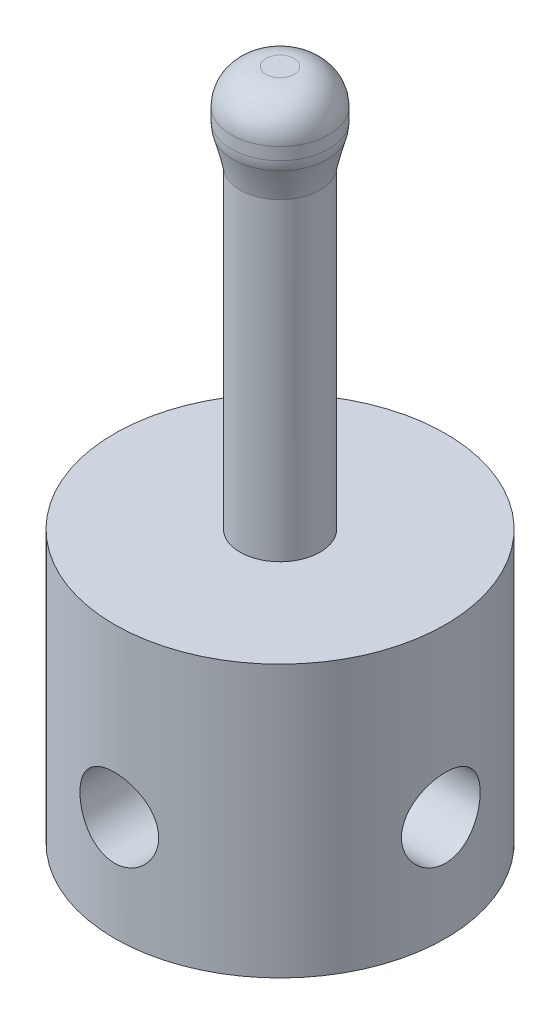
ISO-10303-21;
HEADER;
FILE_DESCRIPTION(('STEP AP214'),'2;1');
FILE_NAME('part.step','',(''),(''),'','','');
FILE_SCHEMA(('AUTOMOTIVE_DESIGN { 1 0 10303 214 1 1 1 1 }'));
ENDSEC;
DATA;
#1=APPLICATION_CONTEXT('core data for automotive mechanical design processes');
#2=APPLICATION_PROTOCOL_DEFINITION('international standard','automotive_design',2000,#1);
#3=PRODUCT_CONTEXT('',#1,'mechanical');
#4=PRODUCT('Part','Part','',(#3));
#5=PRODUCT_RELATED_PRODUCT_CATEGORY('part','',(#4));
#6=PRODUCT_DEFINITION_FORMATION('','',#4);
#7=PRODUCT_DEFINITION_CONTEXT('part definition',#1,'design');
#8=PRODUCT_DEFINITION('design','',#6,#7);
#9=PRODUCT_DEFINITION_SHAPE('','',#8);
#10=(LENGTH_UNIT() NAMED_UNIT(*) SI_UNIT(.MILLI.,.METRE.));
#11=(NAMED_UNIT(*) PLANE_ANGLE_UNIT() SI_UNIT($,.RADIAN.));
#12=(NAMED_UNIT(*) SI_UNIT($,.STERADIAN.) SOLID_ANGLE_UNIT());
#13=UNCERTAINTY_MEASURE_WITH_UNIT(LENGTH_MEASURE(1.E-05),#10,'distance_accuracy_value','');
#14=(GEOMETRIC_REPRESENTATION_CONTEXT(3) GLOBAL_UNCERTAINTY_ASSIGNED_CONTEXT((#13)) GLOBAL_UNIT_ASSIGNED_CONTEXT((#10,
#11,#12)) REPRESENTATION_CONTEXT('',''));
#15=CARTESIAN_POINT('',(0.,0.,0.));
#16=DIRECTION('',(0.,0.,1.));
#17=DIRECTION('',(1.,0.,0.));
#18=AXIS2_PLACEMENT_3D('',#15,#16,#17);
#19=CARTESIAN_POINT('',(0.,45.212,0.));
#20=DIRECTION('',(0.,-1.,0.));
#21=DIRECTION('',(0.,0.,-1.));
#22=AXIS2_PLACEMENT_3D('',#19,#20,#21);
#23=CYLINDRICAL_SURFACE('',#22,2.921);
#24=CARTESIAN_POINT('',(0.,19.812,0.));
#25=DIRECTION('',(0.,1.,0.));
#26=DIRECTION('',(0.,0.,1.));
#27=AXIS2_PLACEMENT_3D('',#24,#25,#26);
#28=CIRCLE('',#27,2.921);
#29=CARTESIAN_POINT('',(0.,19.812,2.921));
#30=VERTEX_POINT('',#29);
#31=EDGE_CURVE('E178',#30,#30,#28,.T.);
#32=ORIENTED_EDGE('',*,*,#31,.T.);
#33=EDGE_LOOP('',(#32));
#34=FACE_BOUND('',#33,.T.);
#35=CARTESIAN_POINT('',(2.78197921367793,42.672,0.890411508609308));
#36=CARTESIAN_POINT('',(4.56280223089655,42.672,-4.67354691874656));
#37=CARTESIAN_POINT('',(-1.00115619645932,42.672,-6.45436993596517));
#38=CARTESIAN_POINT('',(-2.78197921367793,42.672,-0.890411508609307));
#39=CARTESIAN_POINT('',(-4.56280223089655,42.672,4.67354691874656));
#40=CARTESIAN_POINT('',(1.00115619645932,42.672,6.45436993596518));
#41=CARTESIAN_POINT('',(2.78197921367793,42.672,0.890411508609308));
#42=(BOUNDED_CURVE() B_SPLINE_CURVE(3,(#35,#36,#37,#38,#39,#40,#41),.UNSPECIFIED.,.T.,
.F.) B_SPLINE_CURVE_WITH_KNOTS((4,3,4),(0.,0.5,1.),
.UNSPECIFIED.) CURVE() GEOMETRIC_REPRESENTATION_ITEM() RATIONAL_B_SPLINE_CURVE((1.,
0.333333333333333,0.333333333333333,1.,0.333333333333333,0.333333333333333,1.)) REPRESENTATION_ITEM(''));
#43=CARTESIAN_POINT('',(2.78197921367793,42.672,0.890411508609308));
#44=VERTEX_POINT('',#43);
#45=EDGE_CURVE('E81',#44,#44,#42,.T.);
#46=ORIENTED_EDGE('',*,*,#45,.F.);
#47=EDGE_LOOP('',(#46));
#48=FACE_BOUND('',#47,.T.);
#49=ADVANCED_FACE('F43',(#34,#48),#23,.T.);
#50=CARTESIAN_POINT('',(0.,7.62,-12.7));
#51=DIRECTION('',(0.,0.,1.));
#52=DIRECTION('',(1.,0.,0.));
#53=AXIS2_PLACEMENT_3D('',#50,#51,#52);
#54=CYLINDRICAL_SURFACE('',#53,2.8702);
#55=CARTESIAN_POINT('',(2.8702,7.62,11.7186252162956));
#56=CARTESIAN_POINT('',(2.87019507712011,7.4612467948511,11.7186283624697));
#57=CARTESIAN_POINT('',(2.85698399408568,7.30243731393648,11.721886375238));
#58=CARTESIAN_POINT('',(2.80456224388418,6.98936102472241,11.7345369276058));
#59=CARTESIAN_POINT('',(2.76533498344832,6.83509718128338,11.7439333822817));
#60=CARTESIAN_POINT('',(2.66220777124437,6.53568591177346,11.7677377556552));
#61=CARTESIAN_POINT('',(2.59833773696873,6.39052767854076,11.7821395954834));
#62=CARTESIAN_POINT('',(2.44782708582268,6.11297588595014,11.8143245587934));
#63=CARTESIAN_POINT('',(2.36118607051201,5.98058255000424,11.8321077414396));
#64=CARTESIAN_POINT('',(2.16574851562255,5.72967760799566,11.86944844061));
#65=CARTESIAN_POINT('',(2.05658205451984,5.61145797913338,11.8890320853377));
#66=CARTESIAN_POINT('',(1.81998998788974,5.3948224552246,11.9275396495467));
#67=CARTESIAN_POINT('',(1.69256279722548,5.29640828119106,11.9464635115775));
#68=CARTESIAN_POINT('',(1.42108316644156,5.12099855005224,11.9818066094164));
#69=CARTESIAN_POINT('',(1.27684207301624,5.04428743323252,11.9981914146258));
#70=CARTESIAN_POINT('',(0.977058943521645,4.91630707275891,12.0263133715791));
#71=CARTESIAN_POINT('',(0.821518416172498,4.86503443964601,12.0380511424582));
#72=CARTESIAN_POINT('',(0.506592571240832,4.79031495130523,12.0553718215547));
#73=CARTESIAN_POINT('',(0.347330863101816,4.76637290376586,12.0610641281655));
#74=CARTESIAN_POINT('',(0.0269565192068503,4.74544229497584,12.0660328575786));
#75=CARTESIAN_POINT('',(-0.134155864860742,4.74845011094195,12.0653101427316));
#76=CARTESIAN_POINT('',(-0.450232104324782,4.78097259916064,12.0576125705577));
#77=CARTESIAN_POINT('',(-0.605254451761177,4.80995307663434,12.0507637185175));
#78=CARTESIAN_POINT('',(-0.908169690114576,4.89274256770294,12.0317288304518));
#79=CARTESIAN_POINT('',(-1.05606222233691,4.94655282902551,12.0195425262142));
#80=CARTESIAN_POINT('',(-1.34195733835544,5.07792264082235,11.9910052387087));
#81=CARTESIAN_POINT('',(-1.47986676272579,5.15567723940197,11.9746202445134));
#82=CARTESIAN_POINT('',(-1.7408705418565,5.33258167152713,11.9394708155277));
#83=CARTESIAN_POINT('',(-1.86396253510917,5.43173490843722,11.9207060024331));
#84=CARTESIAN_POINT('',(-2.0950202545461,5.65150406837535,11.882305664572));
#85=CARTESIAN_POINT('',(-2.20254037364524,5.7725871948228,11.8626600735999));
#86=CARTESIAN_POINT('',(-2.39584228220077,6.03127120296817,11.8251379870424));
#87=CARTESIAN_POINT('',(-2.48162324254348,6.16887271436887,11.8072615589474));
#88=CARTESIAN_POINT('',(-2.62926132211173,6.45749925143557,11.7752692484766));
#89=CARTESIAN_POINT('',(-2.69102052321649,6.60857619505951,11.7611688291768));
#90=CARTESIAN_POINT('',(-2.7881314686316,6.91938244600731,11.7385289032223));
#91=CARTESIAN_POINT('',(-2.82348826478093,7.07911009182856,11.7299883327856));
#92=CARTESIAN_POINT('',(-2.86607095415289,7.3985755046003,11.7196559281142));
#93=CARTESIAN_POINT('',(-2.873951670472,7.55822101188633,11.7177070323229));
#94=CARTESIAN_POINT('',(-2.86314326147136,7.87654526477713,11.7203526514889));
#95=CARTESIAN_POINT('',(-2.84445632778626,8.03522408904169,11.7249466267078));
#96=CARTESIAN_POINT('',(-2.78161490911294,8.34474068284352,11.740010719636));
#97=CARTESIAN_POINT('',(-2.73783331925917,8.49565874640959,11.7503947397794));
#98=CARTESIAN_POINT('',(-2.62645489538405,8.78801542326033,11.775788800627));
#99=CARTESIAN_POINT('',(-2.55885545058739,8.92945299532468,11.7907993484418));
#100=CARTESIAN_POINT('',(-2.40036086835858,9.20163218932803,11.8240916041208));
#101=CARTESIAN_POINT('',(-2.30906944684217,9.33213631762805,11.8424271807101));
#102=CARTESIAN_POINT('',(-2.10629034792798,9.57621345369849,11.8801674894003));
#103=CARTESIAN_POINT('',(-1.99479967902445,9.68978394905239,11.8995723795697));
#104=CARTESIAN_POINT('',(-1.75179834857281,9.89937778161937,11.9377913448837));
#105=CARTESIAN_POINT('',(-1.61989494375779,9.99495072026906,11.9565824261358));
#106=CARTESIAN_POINT('',(-1.34152823277244,10.1625857493513,11.9910035227366));
#107=CARTESIAN_POINT('',(-1.19506566235932,10.2346490270731,12.0066336977029));
#108=CARTESIAN_POINT('',(-0.892720369182497,10.3526253273366,12.0328765081443));
#109=CARTESIAN_POINT('',(-0.736911255447969,10.39871894667,12.0435237059095));
#110=CARTESIAN_POINT('',(-0.419474774698135,10.463999569568,12.058751526131));
#111=CARTESIAN_POINT('',(-0.257848422963589,10.4831912451882,12.0633332019777));
#112=CARTESIAN_POINT('',(0.0623860488194604,10.4938813686057,12.0658754408616));
#113=CARTESIAN_POINT('',(0.22097096878876,10.4860474925368,12.0639956412166));
#114=CARTESIAN_POINT('',(0.534495154115172,10.4444237618679,12.0541753287779));
#115=CARTESIAN_POINT('',(0.68943450962772,10.4106345498447,12.0462349660256));
#116=CARTESIAN_POINT('',(0.990643308362125,10.3184028088616,12.025205347781));
#117=CARTESIAN_POINT('',(1.13694826801125,10.2600706682665,12.0121391646089));
#118=CARTESIAN_POINT('',(1.41777490361002,10.1205111741056,11.9822412093009));
#119=CARTESIAN_POINT('',(1.55229522074609,10.0392811848743,11.9654090037215));
#120=CARTESIAN_POINT('',(1.80893753933761,9.85413888530335,11.9293398580588));
#121=CARTESIAN_POINT('',(1.93072154509699,9.74976674891245,11.9100581492564));
#122=CARTESIAN_POINT('',(2.15527370777172,9.52220980802151,11.8714797070049));
#123=CARTESIAN_POINT('',(2.25803714451626,9.39902034759528,11.8521829710164));
#124=CARTESIAN_POINT('',(2.44328083409938,9.13488438362675,11.815400607272));
#125=CARTESIAN_POINT('',(2.52539930116137,8.99367892719086,11.7979500270026));
#126=CARTESIAN_POINT('',(2.66460856774315,8.6990767749998,11.7672938346263));
#127=CARTESIAN_POINT('',(2.72171879582258,8.54568965285731,11.7540849293553));
#128=CARTESIAN_POINT('',(2.80009817036185,8.26365811902299,11.7356263002026));
#129=CARTESIAN_POINT('',(2.82633191670105,8.13644109700393,11.7292965233046));
#130=CARTESIAN_POINT('',(2.8613842440036,7.87949513464925,11.7207948386304));
#131=CARTESIAN_POINT('',(2.87020402400848,7.74976636788139,11.7186226445833));
#132=CARTESIAN_POINT('',(2.8702,7.62,11.7186252162956));
#133=B_SPLINE_CURVE_WITH_KNOTS('',3,(#55,#56,#57,#58,#59,#60,#61,#62,#63,#64,#65,#66,#67,#68,
#69,#70,#71,#72,#73,#74,#75,#76,#77,#78,#79,#80,#81,#82,#83,#84,#85,#86,#87,#88,#89,#90,#91,#92,
#93,#94,#95,#96,#97,#98,#99,#100,#101,#102,#103,#104,#105,#106,#107,#108,#109,#110,#111,#112,
#113,#114,#115,#116,#117,#118,#119,#120,#121,#122,#123,#124,#125,#126,#127,#128,#129,#130,#131,
#132),.UNSPECIFIED.,.T.,.F.,(4,2,2,2,2,2,2,2,2,2,2,2,2,2,2,2,2,2,2,2,2,2,2,2,2,2,2,2,2,2,2,2,2,
2,2,2,2,2,4),(0.,0.47578347546477,0.951870700595232,1.42738174286469,1.90290110604732,
2.38695968264342,2.87106030380335,3.36123914703593,3.85135266060468,4.33243756324848,
4.81345779617098,5.28480605798789,5.75617800822378,6.23149609129388,6.70688982751665,
7.19395603784801,7.68104082169047,8.17009077107241,8.65904712159096,9.13626765141134,
9.61344881635103,10.0837166021535,10.554035952032,11.0327954408554,11.5116258919394,
12.0011896985105,12.4907287772117,12.9768201264414,13.4628270458138,13.9369138634531,
14.410988944495,14.8829541635747,15.354973730588,15.8373809469388,16.319907718094,
16.8103785661843,17.3004676952063,17.6894043787698,18.0783142811),.UNSPECIFIED.);
#134=CARTESIAN_POINT('',(2.8702,7.62,11.7186252162956));
#135=VERTEX_POINT('',#134);
#136=EDGE_CURVE('E123',#135,#135,#133,.T.);
#137=ORIENTED_EDGE('',*,*,#136,.F.);
#138=EDGE_LOOP('',(#137));
#139=FACE_BOUND('',#138,.T.);
#140=CARTESIAN_POINT('',(0.,7.62,0.));
#141=DIRECTION('',(0.707106781186546,0.,0.707106781186549));
#142=DIRECTION('',(-0.707106781186549,0.,0.707106781186546));
#143=AXIS2_PLACEMENT_3D('',#140,#141,#142);
#144=ELLIPSE('',#143,4.05907576672325,2.8702);
#145=CARTESIAN_POINT('',(0.,4.7498,0.));
#146=VERTEX_POINT('',#145);
#147=CARTESIAN_POINT('',(0.,10.4902,0.));
#148=VERTEX_POINT('',#147);
#149=EDGE_CURVE('E58',#146,#148,#144,.F.);
#150=ORIENTED_EDGE('',*,*,#149,.T.);
#151=CARTESIAN_POINT('',(0.,7.62,0.));
#152=DIRECTION('',(-0.707106781186549,0.,0.707106781186546));
#153=DIRECTION('',(0.707106781186546,0.,0.707106781186549));
#154=AXIS2_PLACEMENT_3D('',#151,#152,#153);
#155=ELLIPSE('',#154,4.05907576672326,2.8702);
#156=EDGE_CURVE('E67',#148,#146,#155,.F.);
#157=ORIENTED_EDGE('',*,*,#156,.T.);
#158=EDGE_LOOP('',(#150,#157));
#159=FACE_BOUND('',#158,.T.);
#160=ADVANCED_FACE('F79',(#139,#159),#54,.F.);
#161=CARTESIAN_POINT('',(0.,19.812,0.));
#162=DIRECTION('',(0.,-1.,0.));
#163=DIRECTION('',(0.,0.,-1.));
#164=AXIS2_PLACEMENT_3D('',#161,#162,#163);
#165=CYLINDRICAL_SURFACE('',#164,12.065);
#166=CARTESIAN_POINT('',(11.7186252162956,7.62,2.87020000000004));
#167=CARTESIAN_POINT('',(11.7186283624697,7.7787532051489,2.87019507712015));
#168=CARTESIAN_POINT('',(11.721886375238,7.93756268606352,2.85698399408572));
#169=CARTESIAN_POINT('',(11.7345369276058,8.25063897527759,2.80456224388422));
#170=CARTESIAN_POINT('',(11.7439333822817,8.40490281871662,2.76533498344836));
#171=CARTESIAN_POINT('',(11.7677377556552,8.70431408822654,2.66220777124441));
#172=CARTESIAN_POINT('',(11.7821395954834,8.84947232145924,2.59833773696877));
#173=CARTESIAN_POINT('',(11.8143245587934,9.12702411404986,2.44782708582272));
#174=CARTESIAN_POINT('',(11.8321077414395,9.25941744999576,2.36118607051205));
#175=CARTESIAN_POINT('',(11.86944844061,9.51032239200433,2.16574851562259));
#176=CARTESIAN_POINT('',(11.8890320853377,9.62854202086662,2.05658205451988));
#177=CARTESIAN_POINT('',(11.9275396495467,9.8451775447754,1.81998998788978));
#178=CARTESIAN_POINT('',(11.9464635115775,9.94359171880894,1.69256279722552));
#179=CARTESIAN_POINT('',(11.9818066094164,10.1190014499478,1.4210831664416));
#180=CARTESIAN_POINT('',(11.9981914146258,10.1957125667675,1.27684207301628));
#181=CARTESIAN_POINT('',(12.0263133715791,10.3236929272411,0.977058943521689));
#182=CARTESIAN_POINT('',(12.0380511424581,10.374965560354,0.821518416172542));
#183=CARTESIAN_POINT('',(12.0553718215547,10.4496850486948,0.506592571240877));
#184=CARTESIAN_POINT('',(12.0610641281655,10.4736270962341,0.347330863101861));
#185=CARTESIAN_POINT('',(12.0660328575786,10.4945577050242,0.0269565192068951));
#186=CARTESIAN_POINT('',(12.0653101427316,10.491549889058,-0.134155864860698));
#187=CARTESIAN_POINT('',(12.0576125705577,10.4590274008394,-0.450232104324738));
#188=CARTESIAN_POINT('',(12.0507637185175,10.4300469233657,-0.605254451761133));
#189=CARTESIAN_POINT('',(12.0317288304518,10.3472574322971,-0.908169690114532));
#190=CARTESIAN_POINT('',(12.0195425262142,10.2934471709745,-1.05606222233687));
#191=CARTESIAN_POINT('',(11.9910052387087,10.1620773591777,-1.3419573383554));
#192=CARTESIAN_POINT('',(11.9746202445134,10.084322760598,-1.47986676272574));
#193=CARTESIAN_POINT('',(11.9394708155277,9.90741832847287,-1.74087054185646));
#194=CARTESIAN_POINT('',(11.9207060024331,9.80826509156278,-1.86396253510912));
#195=CARTESIAN_POINT('',(11.882305664572,9.58849593162465,-2.09502025454605));
#196=CARTESIAN_POINT('',(11.8626600735999,9.4674128051772,-2.20254037364519));
#197=CARTESIAN_POINT('',(11.8251379870424,9.20872879703183,-2.39584228220073));
#198=CARTESIAN_POINT('',(11.8072615589474,9.07112728563113,-2.48162324254344));
#199=CARTESIAN_POINT('',(11.7752692484766,8.78250074856443,-2.62926132211168));
#200=CARTESIAN_POINT('',(11.7611688291768,8.63142380494049,-2.69102052321645));
#201=CARTESIAN_POINT('',(11.7385289032223,8.32061755399269,-2.78813146863156));
#202=CARTESIAN_POINT('',(11.7299883327856,8.16088990817144,-2.82348826478089));
#203=CARTESIAN_POINT('',(11.7196559281142,7.8414244953997,-2.86607095415285));
#204=CARTESIAN_POINT('',(11.7177070323229,7.68177898811367,-2.87395167047196));
#205=CARTESIAN_POINT('',(11.7203526514889,7.36345473522287,-2.86314326147132));
#206=CARTESIAN_POINT('',(11.7249466267079,7.20477591095831,-2.84445632778622));
#207=CARTESIAN_POINT('',(11.740010719636,6.89525931715648,-2.7816149091129));
#208=CARTESIAN_POINT('',(11.7503947397794,6.74434125359041,-2.73783331925913));
#209=CARTESIAN_POINT('',(11.775788800627,6.45198457673967,-2.62645489538401));
#210=CARTESIAN_POINT('',(11.7907993484419,6.31054700467531,-2.55885545058734));
#211=CARTESIAN_POINT('',(11.8240916041208,6.03836781067197,-2.40036086835854));
#212=CARTESIAN_POINT('',(11.8424271807101,5.90786368237195,-2.30906944684213));
#213=CARTESIAN_POINT('',(11.8801674894003,5.66378654630151,-2.10629034792794));
#214=CARTESIAN_POINT('',(11.8995723795697,5.55021605094761,-1.99479967902441));
#215=CARTESIAN_POINT('',(11.9377913448837,5.34062221838063,-1.75179834857277));
#216=CARTESIAN_POINT('',(11.9565824261358,5.24504927973094,-1.61989494375775));
#217=CARTESIAN_POINT('',(11.9910035227366,5.07741425064869,-1.3415282327724));
#218=CARTESIAN_POINT('',(12.0066336977029,5.00535097292692,-1.19506566235928));
#219=CARTESIAN_POINT('',(12.0328765081443,4.88737467266335,-0.892720369182458));
#220=CARTESIAN_POINT('',(12.0435237059095,4.84128105332999,-0.736911255447928));
#221=CARTESIAN_POINT('',(12.058751526131,4.77600043043198,-0.419474774698094));
#222=CARTESIAN_POINT('',(12.0633332019777,4.75680875481179,-0.257848422963548));
#223=CARTESIAN_POINT('',(12.0658754408616,4.74611863139429,0.062386048819501));
#224=CARTESIAN_POINT('',(12.0639956412166,4.75395250746322,0.2209709687888));
#225=CARTESIAN_POINT('',(12.0541753287779,4.79557623813209,0.534495154115213));
#226=CARTESIAN_POINT('',(12.0462349660256,4.82936545015531,0.689434509627761));
#227=CARTESIAN_POINT('',(12.025205347781,4.92159719113841,0.990643308362166));
#228=CARTESIAN_POINT('',(12.0121391646089,4.97992933173355,1.1369482680113));
#229=CARTESIAN_POINT('',(11.9822412093009,5.11948882589442,1.41777490361006));
#230=CARTESIAN_POINT('',(11.9654090037215,5.20071881512568,1.55229522074613));
#231=CARTESIAN_POINT('',(11.9293398580588,5.38586111469665,1.80893753933764));
#232=CARTESIAN_POINT('',(11.9100581492564,5.49023325108755,1.93072154509703));
#233=CARTESIAN_POINT('',(11.8714797070049,5.71779019197849,2.15527370777176));
#234=CARTESIAN_POINT('',(11.8521829710164,5.84097965240471,2.2580371445163));
#235=CARTESIAN_POINT('',(11.815400607272,6.10511561637324,2.44328083409942));
#236=CARTESIAN_POINT('',(11.7979500270025,6.24632107280913,2.52539930116141));
#237=CARTESIAN_POINT('',(11.7672938346263,6.5409232250002,2.66460856774319));
#238=CARTESIAN_POINT('',(11.7540849293553,6.69431034714268,2.72171879582262));
#239=CARTESIAN_POINT('',(11.7356263002026,6.97634188097701,2.80009817036189));
#240=CARTESIAN_POINT('',(11.7292965233046,7.10355890299607,2.82633191670109));
#241=CARTESIAN_POINT('',(11.7207948386304,7.36050486535075,2.86138424400364));
#242=CARTESIAN_POINT('',(11.7186226445833,7.4902336321186,2.87020402400852));
#243=CARTESIAN_POINT('',(11.7186252162956,7.62,2.87020000000004));
#244=B_SPLINE_CURVE_WITH_KNOTS('',3,(#166,#167,#168,#169,#170,#171,#172,#173,#174,#175,#176,
#177,#178,#179,#180,#181,#182,#183,#184,#185,#186,#187,#188,#189,#190,#191,#192,#193,#194,#195,
#196,#197,#198,#199,#200,#201,#202,#203,#204,#205,#206,#207,#208,#209,#210,#211,#212,#213,#214,
#215,#216,#217,#218,#219,#220,#221,#222,#223,#224,#225,#226,#227,#228,#229,#230,#231,#232,#233,
#234,#235,#236,#237,#238,#239,#240,#241,#242,#243),.UNSPECIFIED.,.T.,.F.,(4,2,2,2,2,2,2,2,2,2,2,
2,2,2,2,2,2,2,2,2,2,2,2,2,2,2,2,2,2,2,2,2,2,2,2,2,2,2,4),(0.,0.47578347546477,0.95187070059523,
1.42738174286468,1.90290110604731,2.38695968264341,2.87106030380335,3.36123914703593,
3.85135266060468,4.33243756324848,4.81345779617098,5.28480605798789,5.75617800822378,
6.23149609129388,6.70688982751665,7.19395603784801,7.68104082169047,8.17009077107241,
8.65904712159096,9.13626765141134,9.61344881635103,10.0837166021535,10.554035952032,
11.0327954408554,11.5116258919394,12.0011896985105,12.4907287772117,12.9768201264414,
13.4628270458138,13.9369138634531,14.410988944495,14.8829541635747,15.354973730588,
15.8373809469388,16.319907718094,16.8103785661843,17.3004676952063,17.6894043787698,
18.0783142810999),.UNSPECIFIED.);
#245=CARTESIAN_POINT('',(11.7186252162956,7.62,2.87020000000004));
#246=VERTEX_POINT('',#245);
#247=EDGE_CURVE('E145',#246,#246,#244,.T.);
#248=ORIENTED_EDGE('',*,*,#247,.T.);
#249=EDGE_LOOP('',(#248));
#250=FACE_BOUND('',#249,.T.);
#251=CARTESIAN_POINT('',(-11.7186252162956,7.62,2.87019999999996));
#252=CARTESIAN_POINT('',(-11.7186283624697,7.4612467948511,2.87019507712007));
#253=CARTESIAN_POINT('',(-11.721886375238,7.30243731393648,2.85698399408564));
#254=CARTESIAN_POINT('',(-11.7345369276058,6.98936102472241,2.80456224388414));
#255=CARTESIAN_POINT('',(-11.7439333822817,6.83509718128338,2.76533498344828));
#256=CARTESIAN_POINT('',(-11.7677377556552,6.53568591177346,2.66220777124433));
#257=CARTESIAN_POINT('',(-11.7821395954834,6.39052767854076,2.59833773696869));
#258=CARTESIAN_POINT('',(-11.8143245587934,6.11297588595014,2.44782708582263));
#259=CARTESIAN_POINT('',(-11.8321077414396,5.98058255000424,2.36118607051197));
#260=CARTESIAN_POINT('',(-11.86944844061,5.72967760799566,2.16574851562251));
#261=CARTESIAN_POINT('',(-11.8890320853377,5.61145797913337,2.0565820545198));
#262=CARTESIAN_POINT('',(-11.9275396495467,5.3948224552246,1.81998998788969));
#263=CARTESIAN_POINT('',(-11.9464635115775,5.29640828119106,1.69256279722543));
#264=CARTESIAN_POINT('',(-11.9818066094164,5.12099855005224,1.42108316644152));
#265=CARTESIAN_POINT('',(-11.9981914146258,5.04428743323252,1.27684207301619));
#266=CARTESIAN_POINT('',(-12.0263133715791,4.91630707275891,0.977058943521602));
#267=CARTESIAN_POINT('',(-12.0380511424582,4.86503443964601,0.821518416172456));
#268=CARTESIAN_POINT('',(-12.0553718215547,4.79031495130523,0.50659257124079));
#269=CARTESIAN_POINT('',(-12.0610641281655,4.76637290376586,0.347330863101774));
#270=CARTESIAN_POINT('',(-12.0660328575786,4.74544229497584,0.0269565192068076));
#271=CARTESIAN_POINT('',(-12.0653101427316,4.74845011094195,-0.134155864860785));
#272=CARTESIAN_POINT('',(-12.0576125705577,4.78097259916064,-0.450232104324824));
#273=CARTESIAN_POINT('',(-12.0507637185175,4.80995307663434,-0.605254451761219));
#274=CARTESIAN_POINT('',(-12.0317288304518,4.89274256770294,-0.908169690114618));
#275=CARTESIAN_POINT('',(-12.0195425262142,4.94655282902551,-1.05606222233696));
#276=CARTESIAN_POINT('',(-11.9910052387087,5.07792264082235,-1.34195733835548));
#277=CARTESIAN_POINT('',(-11.9746202445134,5.15567723940197,-1.47986676272583));
#278=CARTESIAN_POINT('',(-11.9394708155277,5.33258167152713,-1.74087054185655));
#279=CARTESIAN_POINT('',(-11.9207060024331,5.43173490843722,-1.86396253510921));
#280=CARTESIAN_POINT('',(-11.882305664572,5.65150406837535,-2.09502025454614));
#281=CARTESIAN_POINT('',(-11.8626600735999,5.7725871948228,-2.20254037364528));
#282=CARTESIAN_POINT('',(-11.8251379870424,6.03127120296817,-2.39584228220081));
#283=CARTESIAN_POINT('',(-11.8072615589473,6.16887271436887,-2.48162324254353));
#284=CARTESIAN_POINT('',(-11.7752692484766,6.45749925143557,-2.62926132211177));
#285=CARTESIAN_POINT('',(-11.7611688291768,6.60857619505951,-2.69102052321653));
#286=CARTESIAN_POINT('',(-11.7385289032223,6.91938244600731,-2.78813146863164));
#287=CARTESIAN_POINT('',(-11.7299883327856,7.07911009182856,-2.82348826478097));
#288=CARTESIAN_POINT('',(-11.7196559281142,7.3985755046003,-2.86607095415293));
#289=CARTESIAN_POINT('',(-11.7177070323229,7.55822101188633,-2.87395167047204));
#290=CARTESIAN_POINT('',(-11.7203526514889,7.87654526477713,-2.8631432614714));
#291=CARTESIAN_POINT('',(-11.7249466267078,8.03522408904169,-2.84445632778631));
#292=CARTESIAN_POINT('',(-11.740010719636,8.34474068284352,-2.78161490911298));
#293=CARTESIAN_POINT('',(-11.7503947397794,8.49565874640959,-2.73783331925922));
#294=CARTESIAN_POINT('',(-11.775788800627,8.78801542326033,-2.62645489538409));
#295=CARTESIAN_POINT('',(-11.7907993484418,8.92945299532468,-2.55885545058743));
#296=CARTESIAN_POINT('',(-11.8240916041208,9.20163218932803,-2.40036086835862));
#297=CARTESIAN_POINT('',(-11.8424271807101,9.33213631762805,-2.30906944684221));
#298=CARTESIAN_POINT('',(-11.8801674894002,9.57621345369849,-2.10629034792802));
#299=CARTESIAN_POINT('',(-11.8995723795697,9.68978394905239,-1.99479967902449));
#300=CARTESIAN_POINT('',(-11.9377913448837,9.89937778161937,-1.75179834857285));
#301=CARTESIAN_POINT('',(-11.9565824261358,9.99495072026906,-1.61989494375783));
#302=CARTESIAN_POINT('',(-11.9910035227366,10.1625857493513,-1.34152823277249));
#303=CARTESIAN_POINT('',(-12.0066336977029,10.2346490270731,-1.19506566235936));
#304=CARTESIAN_POINT('',(-12.0328765081443,10.3526253273366,-0.892720369182539));
#305=CARTESIAN_POINT('',(-12.0435237059095,10.39871894667,-0.73691125544801));
#306=CARTESIAN_POINT('',(-12.058751526131,10.463999569568,-0.419474774698176));
#307=CARTESIAN_POINT('',(-12.0633332019777,10.4831912451882,-0.25784842296363));
#308=CARTESIAN_POINT('',(-12.0658754408616,10.4938813686057,0.0623860488194192));
#309=CARTESIAN_POINT('',(-12.0639956412166,10.4860474925368,0.220970968788719));
#310=CARTESIAN_POINT('',(-12.0541753287779,10.4444237618679,0.534495154115131));
#311=CARTESIAN_POINT('',(-12.0462349660256,10.4106345498447,0.689434509627679));
#312=CARTESIAN_POINT('',(-12.025205347781,10.3184028088616,0.990643308362083));
#313=CARTESIAN_POINT('',(-12.0121391646089,10.2600706682665,1.13694826801121));
#314=CARTESIAN_POINT('',(-11.9822412093009,10.1205111741056,1.41777490360997));
#315=CARTESIAN_POINT('',(-11.9654090037215,10.0392811848743,1.55229522074605));
#316=CARTESIAN_POINT('',(-11.9293398580588,9.85413888530335,1.80893753933756));
#317=CARTESIAN_POINT('',(-11.9100581492564,9.74976674891245,1.93072154509695));
#318=CARTESIAN_POINT('',(-11.8714797070049,9.52220980802151,2.15527370777168));
#319=CARTESIAN_POINT('',(-11.8521829710164,9.39902034759528,2.25803714451622));
#320=CARTESIAN_POINT('',(-11.815400607272,9.13488438362675,2.44328083409934));
#321=CARTESIAN_POINT('',(-11.7979500270026,8.99367892719086,2.52539930116133));
#322=CARTESIAN_POINT('',(-11.7672938346263,8.69907677499979,2.66460856774311));
#323=CARTESIAN_POINT('',(-11.7540849293553,8.54568965285731,2.72171879582254));
#324=CARTESIAN_POINT('',(-11.7356263002026,8.26365811902299,2.80009817036181));
#325=CARTESIAN_POINT('',(-11.7292965233046,8.13644109700393,2.82633191670101));
#326=CARTESIAN_POINT('',(-11.7207948386304,7.87949513464925,2.86138424400356));
#327=CARTESIAN_POINT('',(-11.7186226445833,7.74976636788139,2.87020402400843));
#328=CARTESIAN_POINT('',(-11.7186252162956,7.62,2.87019999999996));
#329=B_SPLINE_CURVE_WITH_KNOTS('',3,(#251,#252,#253,#254,#255,#256,#257,#258,#259,#260,#261,
#262,#263,#264,#265,#266,#267,#268,#269,#270,#271,#272,#273,#274,#275,#276,#277,#278,#279,#280,
#281,#282,#283,#284,#285,#286,#287,#288,#289,#290,#291,#292,#293,#294,#295,#296,#297,#298,#299,
#300,#301,#302,#303,#304,#305,#306,#307,#308,#309,#310,#311,#312,#313,#314,#315,#316,#317,#318,
#319,#320,#321,#322,#323,#324,#325,#326,#327,#328),.UNSPECIFIED.,.T.,.F.,(4,2,2,2,2,2,2,2,2,2,2,
2,2,2,2,2,2,2,2,2,2,2,2,2,2,2,2,2,2,2,2,2,2,2,2,2,2,2,4),(0.,0.475783475464769,
0.951870700595232,1.42738174286469,1.90290110604732,2.38695968264342,2.87106030380335,
3.36123914703593,3.85135266060468,4.33243756324848,4.81345779617098,5.28480605798789,
5.75617800822378,6.23149609129388,6.70688982751665,7.19395603784801,7.68104082169047,
8.17009077107241,8.65904712159096,9.13626765141134,9.61344881635103,10.0837166021535,
10.554035952032,11.0327954408554,11.5116258919394,12.0011896985105,12.4907287772117,
12.9768201264414,13.4628270458138,13.9369138634531,14.410988944495,14.8829541635747,
15.354973730588,15.8373809469388,16.319907718094,16.8103785661843,17.3004676952063,
17.6894043787699,18.0783142811),.UNSPECIFIED.);
#330=CARTESIAN_POINT('',(-11.7186252162956,7.62,2.87019999999996));
#331=VERTEX_POINT('',#330);
#332=EDGE_CURVE('E137',#331,#331,#329,.T.);
#333=ORIENTED_EDGE('',*,*,#332,.T.);
#334=EDGE_LOOP('',(#333));
#335=FACE_BOUND('',#334,.T.);
#336=CARTESIAN_POINT('',(0.,10.4902,-12.065));
#337=CARTESIAN_POINT('',(-0.158824907950164,10.4901951234931,-12.0649971778249));
#338=CARTESIAN_POINT('',(-0.317705986555829,10.4769725118932,-12.0618323183688));
#339=CARTESIAN_POINT('',(-0.630930845699007,10.4245008258766,-12.0495133144309));
#340=CARTESIAN_POINT('',(-0.785271722493978,10.3852354578577,-12.040355420466));
#341=CARTESIAN_POINT('',(-1.08484630257646,10.2819968725331,-12.0170666894324));
#342=CARTESIAN_POINT('',(-1.23009015870909,10.2180517917785,-12.0029415170225));
#343=CARTESIAN_POINT('',(-1.50778680947865,10.0673641343157,-11.9712306211082));
#344=CARTESIAN_POINT('',(-1.6402394730638,9.98062132406808,-11.9536448621541));
#345=CARTESIAN_POINT('',(-1.89108328498829,9.78507848382942,-11.9165596776867));
#346=CARTESIAN_POINT('',(-2.00919991008601,9.67593143814671,-11.8970330012808));
#347=CARTESIAN_POINT('',(-2.2256349683712,9.43942218609661,-11.8584521246031));
#348=CARTESIAN_POINT('',(-2.32395136505951,9.31205810836709,-11.8393979731079));
#349=CARTESIAN_POINT('',(-2.49925397766034,9.04063955851702,-11.8036473542764));
#350=CARTESIAN_POINT('',(-2.57593907546152,8.89638561385081,-11.7869856188773));
#351=CARTESIAN_POINT('',(-2.70386785802467,8.59657486248681,-11.7583013570548));
#352=CARTESIAN_POINT('',(-2.7551151913825,8.44101968042222,-11.7462781653699));
#353=CARTESIAN_POINT('',(-2.82978890064101,8.12602491499282,-11.7285114235511));
#354=CARTESIAN_POINT('',(-2.85370591491807,7.96670802214166,-11.7226572801798));
#355=CARTESIAN_POINT('',(-2.87456729670919,7.64622384186784,-11.7175599971893));
#356=CARTESIAN_POINT('',(-2.8715156149473,7.48505682892932,-11.7183158892464));
#357=CARTESIAN_POINT('',(-2.83891904028402,7.16916156145021,-11.726253565271));
#358=CARTESIAN_POINT('',(-2.80995278940411,7.01436952705976,-11.7332949929553));
#359=CARTESIAN_POINT('',(-2.72726983969308,6.71190734222375,-11.7527873879626));
#360=CARTESIAN_POINT('',(-2.67355152700903,6.56423765685429,-11.7652387080116));
#361=CARTESIAN_POINT('',(-2.54238102064708,6.27863031117989,-11.7942805485561));
#362=CARTESIAN_POINT('',(-2.46471383796333,6.14079533278994,-11.8109082993479));
#363=CARTESIAN_POINT('',(-2.28800093913081,5.87990436897229,-11.8464077413594));
#364=CARTESIAN_POINT('',(-2.18895181055944,5.75685074743979,-11.8652797905386));
#365=CARTESIAN_POINT('',(-1.96926287657427,5.52569313212781,-11.9037369582856));
#366=CARTESIAN_POINT('',(-1.84813321867078,5.41805512641542,-11.9233279318042));
#367=CARTESIAN_POINT('',(-1.58931207735523,5.22453669104959,-11.9605760589759));
#368=CARTESIAN_POINT('',(-1.45162017777886,5.13865680828739,-11.9782331640148));
#369=CARTESIAN_POINT('',(-1.16295701269643,4.99094414113202,-12.0096989296947));
#370=CARTESIAN_POINT('',(-1.01194873571135,4.92918114581702,-12.0234963891535));
#371=CARTESIAN_POINT('',(-0.701293387185554,4.83204220313647,-12.0456062414823));
#372=CARTESIAN_POINT('',(-0.541647812940406,4.79666169792482,-12.0539195817614));
#373=CARTESIAN_POINT('',(-0.222238889988145,4.75399004773035,-12.0639864471148));
#374=CARTESIAN_POINT('',(-0.0625649749576446,4.74606355999547,-12.0658883186173));
#375=CARTESIAN_POINT('',(0.255826545545747,4.75679062296533,-12.0633377354052));
#376=CARTESIAN_POINT('',(0.4145442274329,4.77544202071588,-12.0588857953841));
#377=CARTESIAN_POINT('',(0.724351330843538,4.8382702761661,-12.0442223153757));
#378=CARTESIAN_POINT('',(0.875513930206462,4.88210588823309,-12.0340878171978));
#379=CARTESIAN_POINT('',(1.1683361031062,4.99367290057723,-12.0091976706272));
#380=CARTESIAN_POINT('',(1.30999477101686,5.06140657425378,-11.9944415826021));
#381=CARTESIAN_POINT('',(1.58235591737689,5.22011520468578,-11.9615850731518));
#382=CARTESIAN_POINT('',(1.71284067173753,5.31145302278367,-11.9434337840773));
#383=CARTESIAN_POINT('',(1.95685759559938,5.51430788208132,-11.9058893643878));
#384=CARTESIAN_POINT('',(2.070387126176,5.62582805851776,-11.8864960411313));
#385=CARTESIAN_POINT('',(2.27984710100094,5.86881930881058,-11.8481277950048));
#386=CARTESIAN_POINT('',(2.37533398152209,6.00067628171169,-11.8291715441623));
#387=CARTESIAN_POINT('',(2.54281793503326,6.27892275117131,-11.7943057981026));
#388=CARTESIAN_POINT('',(2.61481605938258,6.42531159689894,-11.7783961665316));
#389=CARTESIAN_POINT('',(2.73275692338106,6.72766747363016,-11.7515924231113));
#390=CARTESIAN_POINT('',(2.77885296480023,6.88357196281972,-11.7406688748919));
#391=CARTESIAN_POINT('',(2.84410630358111,7.20121323880353,-11.7250343759771));
#392=CARTESIAN_POINT('',(2.86326883847909,7.36294888538491,-11.7203222174153));
#393=CARTESIAN_POINT('',(2.87385743107945,7.68316519746291,-11.7177298025343));
#394=CARTESIAN_POINT('',(2.8659899871983,7.84162148550353,-11.7196755199806));
#395=CARTESIAN_POINT('',(2.82434381296913,8.15487927637721,-11.7297807919155));
#396=CARTESIAN_POINT('',(2.79056551144649,8.30968083965235,-11.7379402435668));
#397=CARTESIAN_POINT('',(2.69842503418613,8.61054994103726,-11.7594613801431));
#398=CARTESIAN_POINT('',(2.64018348009919,8.75665637058919,-11.7727975160964));
#399=CARTESIAN_POINT('',(2.50086751493638,9.03712256040662,-11.8031753097713));
#400=CARTESIAN_POINT('',(2.41979024203109,9.17148084559786,-11.8202174318753));
#401=CARTESIAN_POINT('',(2.23483804134793,9.4280788647108,-11.8565927263547));
#402=CARTESIAN_POINT('',(2.13046745980858,9.54995505309758,-11.875970693825));
#403=CARTESIAN_POINT('',(1.90287302948631,9.77469384969896,-11.9145539848249));
#404=CARTESIAN_POINT('',(1.77964476800188,9.87755199521484,-11.9337592668296));
#405=CARTESIAN_POINT('',(1.51545817097579,10.0629262062562,-11.9701985732947));
#406=CARTESIAN_POINT('',(1.3742480965035,10.1450911450788,-11.9873962152866));
#407=CARTESIAN_POINT('',(1.07963007865756,10.2843861035807,-12.0175070761845));
#408=CARTESIAN_POINT('',(0.926231592160084,10.3415353128983,-12.0304235773126));
#409=CARTESIAN_POINT('',(0.644103523671167,10.4200004247591,-12.0484463369766));
#410=CARTESIAN_POINT('',(0.516796521713548,10.4462711304047,-12.0546130417361));
#411=CARTESIAN_POINT('',(0.259672092688866,10.4813723755768,-12.0628909023172));
#412=CARTESIAN_POINT('',(0.129854820414038,10.490203987019,-12.0650023074028));
#413=CARTESIAN_POINT('',(0.,10.4902,-12.065));
#414=B_SPLINE_CURVE_WITH_KNOTS('',3,(#336,#337,#338,#339,#340,#341,#342,#343,#344,#345,#346,
#347,#348,#349,#350,#351,#352,#353,#354,#355,#356,#357,#358,#359,#360,#361,#362,#363,#364,#365,
#366,#367,#368,#369,#370,#371,#372,#373,#374,#375,#376,#377,#378,#379,#380,#381,#382,#383,#384,
#385,#386,#387,#388,#389,#390,#391,#392,#393,#394,#395,#396,#397,#398,#399,#400,#401,#402,#403,
#404,#405,#406,#407,#408,#409,#410,#411,#412,#413),.UNSPECIFIED.,.T.,.F.,(4,2,2,2,2,2,2,2,2,2,2,
2,2,2,2,2,2,2,2,2,2,2,2,2,2,2,2,2,2,2,2,2,2,2,2,2,2,2,4),(0.,0.475999079815324,
0.952296248849095,1.4280520031222,1.90381263121988,2.38758932300433,2.8714157469545,
3.36167778002683,3.85186947337705,4.33311565061533,4.81429132984634,5.28498388975409,
5.75570714351198,6.23078555779016,6.70593984768932,7.19331692362536,7.68070624858751,
8.16949570208847,8.65820069261516,9.13551759296095,9.61279583022329,10.0837545551459,
10.5547580939999,11.0334843419562,11.5122850217724,12.0016497274584,12.4909925261203,
12.9774077874774,13.4637284465883,13.9374356144293,14.4111349425732,14.8825255093482,
15.3539751782746,15.8366203363049,16.3193786066003,16.8098471527437,17.2999387968675,
17.6891382961964,18.0783138721461),.UNSPECIFIED.);
#415=CARTESIAN_POINT('',(0.,10.4902,-12.065));
#416=VERTEX_POINT('',#415);
#417=EDGE_CURVE('E132',#416,#416,#414,.T.);
#418=ORIENTED_EDGE('',*,*,#417,.T.);
#419=EDGE_LOOP('',(#418));
#420=FACE_BOUND('',#419,.T.);
#421=ORIENTED_EDGE('',*,*,#136,.T.);
#422=EDGE_LOOP('',(#421));
#423=FACE_BOUND('',#422,.T.);
#424=CARTESIAN_POINT('',(0.,19.812,0.));
#425=DIRECTION('',(0.,1.,0.));
#426=DIRECTION('',(0.,0.,1.));
#427=AXIS2_PLACEMENT_3D('',#424,#425,#426);
#428=CIRCLE('',#427,12.065);
#429=CARTESIAN_POINT('',(0.,19.812,12.065));
#430=VERTEX_POINT('',#429);
#431=EDGE_CURVE('E184',#430,#430,#428,.T.);
#432=ORIENTED_EDGE('',*,*,#431,.F.);
#433=EDGE_LOOP('',(#432));
#434=FACE_BOUND('',#433,.T.);
#435=CARTESIAN_POINT('',(0.,0.,0.));
#436=DIRECTION('',(0.,1.,0.));
#437=DIRECTION('',(0.,0.,1.));
#438=AXIS2_PLACEMENT_3D('',#435,#436,#437);
#439=CIRCLE('',#438,12.065);
#440=CARTESIAN_POINT('',(0.,0.,12.065));
#441=VERTEX_POINT('',#440);
#442=EDGE_CURVE('E186',#441,#441,#439,.T.);
#443=ORIENTED_EDGE('',*,*,#442,.T.);
#444=EDGE_LOOP('',(#443));
#445=FACE_BOUND('',#444,.T.);
#446=ADVANCED_FACE('F111',(#250,#335,#420,#423,#434,#445),#165,.T.);
#447=CARTESIAN_POINT('',(0.,19.812,0.));
#448=DIRECTION('',(0.,1.,0.));
#449=DIRECTION('',(0.,0.,1.));
#450=AXIS2_PLACEMENT_3D('',#447,#448,#449);
#451=PLANE('',#450);
#452=ORIENTED_EDGE('',*,*,#31,.F.);
#453=EDGE_LOOP('',(#452));
#454=FACE_BOUND('',#453,.T.);
#455=ORIENTED_EDGE('',*,*,#431,.T.);
#456=EDGE_LOOP('',(#455));
#457=FACE_BOUND('',#456,.T.);
#458=ADVANCED_FACE('F107',(#454,#457),#451,.T.);
#459=CARTESIAN_POINT('',(0.,0.,0.));
#460=DIRECTION('',(0.,1.,0.));
#461=DIRECTION('',(0.,0.,1.));
#462=AXIS2_PLACEMENT_3D('',#459,#460,#461);
#463=PLANE('',#462);
#464=ORIENTED_EDGE('',*,*,#442,.F.);
#465=EDGE_LOOP('',(#464));
#466=FACE_BOUND('',#465,.T.);
#467=ADVANCED_FACE('F110',(#466),#463,.F.);
#468=CARTESIAN_POINT('',(0.,7.62,0.));
#469=DIRECTION('',(0.707106781186546,0.,0.707106781186549));
#470=DIRECTION('',(-0.707106781186549,0.,0.707106781186546));
#471=AXIS2_PLACEMENT_3D('',#468,#469,#470);
#472=ELLIPSE('',#471,4.05907576672325,2.8702);
#473=EDGE_CURVE('E64',#146,#148,#472,.T.);
#474=ORIENTED_EDGE('',*,*,#473,.T.);
#475=CARTESIAN_POINT('',(0.,7.62,0.));
#476=DIRECTION('',(-0.707106781186549,0.,0.707106781186546));
#477=DIRECTION('',(0.707106781186546,0.,0.707106781186549));
#478=AXIS2_PLACEMENT_3D('',#475,#476,#477);
#479=ELLIPSE('',#478,4.05907576672326,2.8702);
#480=EDGE_CURVE('E71',#148,#146,#479,.T.);
#481=ORIENTED_EDGE('',*,*,#480,.T.);
#482=EDGE_LOOP('',(#474,#481));
#483=FACE_BOUND('',#482,.T.);
#484=ORIENTED_EDGE('',*,*,#417,.F.);
#485=EDGE_LOOP('',(#484));
#486=FACE_BOUND('',#485,.T.);
#487=ADVANCED_FACE('F83',(#483,#486),#54,.F.);
#488=CARTESIAN_POINT('',(12.7,7.62,0.));
#489=DIRECTION('',(-1.,0.,0.));
#490=DIRECTION('',(0.,0.,1.));
#491=AXIS2_PLACEMENT_3D('',#488,#489,#490);
#492=CYLINDRICAL_SURFACE('',#491,2.8702);
#493=ORIENTED_EDGE('',*,*,#149,.F.);
#494=ORIENTED_EDGE('',*,*,#480,.F.);
#495=EDGE_LOOP('',(#493,#494));
#496=FACE_BOUND('',#495,.T.);
#497=ORIENTED_EDGE('',*,*,#332,.F.);
#498=EDGE_LOOP('',(#497));
#499=FACE_BOUND('',#498,.T.);
#500=ADVANCED_FACE('F74',(#496,#499),#492,.F.);
#501=ORIENTED_EDGE('',*,*,#473,.F.);
#502=ORIENTED_EDGE('',*,*,#156,.F.);
#503=EDGE_LOOP('',(#501,#502));
#504=FACE_BOUND('',#503,.T.);
#505=ORIENTED_EDGE('',*,*,#247,.F.);
#506=EDGE_LOOP('',(#505));
#507=FACE_BOUND('',#506,.T.);
#508=ADVANCED_FACE('F65',(#504,#507),#492,.F.);
#509=CARTESIAN_POINT('',(3.55594314412404,45.212,0.0201085990861835));
#510=CARTESIAN_POINT('',(2.78197921367793,42.672,0.890411508609308));
#511=CARTESIAN_POINT('',(3.51572594595168,45.212,7.13199488733427));
#512=CARTESIAN_POINT('',(1.00115619645932,42.672,6.45436993596518));
#513=CARTESIAN_POINT('',(-3.59616034229641,45.212,7.0917776891619));
#514=CARTESIAN_POINT('',(-4.56280223089655,42.672,4.67354691874656));
#515=CARTESIAN_POINT('',(-3.55594314412404,45.212,-0.0201085990861839));
#516=CARTESIAN_POINT('',(-2.78197921367793,42.672,-0.890411508609307));
#517=CARTESIAN_POINT('',(-3.51572594595168,45.212,-7.13199488733427));
#518=CARTESIAN_POINT('',(-1.00115619645932,42.672,-6.45436993596517));
#519=CARTESIAN_POINT('',(3.59616034229641,45.212,-7.0917776891619));
#520=CARTESIAN_POINT('',(4.56280223089655,42.672,-4.67354691874656));
#521=CARTESIAN_POINT('',(3.55594314412404,45.212,0.0201085990861835));
#522=CARTESIAN_POINT('',(2.78197921367793,42.672,0.890411508609308));
#523=(BOUNDED_SURFACE() B_SPLINE_SURFACE(3,1,((#509,#510),(#511,#512),(#513,#514),(#515,#516),
(#517,#518),(#519,#520),(#521,#522)),.UNSPECIFIED.,.T.,.F.,.F.) B_SPLINE_SURFACE_WITH_KNOTS((4,
3,4),(2,2),(0.,0.5,1.),(0.,1.),
.UNSPECIFIED.) GEOMETRIC_REPRESENTATION_ITEM() RATIONAL_B_SPLINE_SURFACE(((1.,1.),
(0.333333333333333,0.333333333333333),(0.333333333333333,0.333333333333333),(1.,1.),
(0.333333333333334,0.333333333333333),(0.333333333333334,0.333333333333333),(1.,1.))) REPRESENTATION_ITEM('') SURFACE());
#524=CARTESIAN_POINT('',(0.,44.871499765817,0.));
#525=DIRECTION('',(0.,-1.,0.));
#526=DIRECTION('',(0.,0.,-1.));
#527=AXIS2_PLACEMENT_3D('',#524,#525,#526);
#528=CIRCLE('',#527,3.45489777095483);
#529=CARTESIAN_POINT('',(0.,44.871499765817,-3.45489777095483));
#530=VERTEX_POINT('',#529);
#531=EDGE_CURVE('E52',#530,#530,#528,.T.);
#532=ORIENTED_EDGE('',*,*,#531,.T.);
#533=EDGE_LOOP('',(#532));
#534=FACE_BOUND('',#533,.T.);
#535=ORIENTED_EDGE('',*,*,#45,.T.);
#536=EDGE_LOOP('',(#535));
#537=FACE_BOUND('',#536,.T.);
#538=ADVANCED_FACE('F156',(#534,#537),#523,.T.);
#539=CARTESIAN_POINT('',(0.,49.022,0.));
#540=DIRECTION('',(0.,1.,0.));
#541=DIRECTION('',(0.,0.,1.));
#542=AXIS2_PLACEMENT_3D('',#539,#540,#541);
#543=PLANE('',#542);
#544=CARTESIAN_POINT('',(0.,49.022,0.));
#545=DIRECTION('',(0.,1.,0.));
#546=DIRECTION('',(0.,0.,1.));
#547=AXIS2_PLACEMENT_3D('',#544,#545,#546);
#548=CIRCLE('',#547,1.016);
#549=CARTESIAN_POINT('',(0.,49.022,1.016));
#550=VERTEX_POINT('',#549);
#551=EDGE_CURVE('E175',#550,#550,#548,.T.);
#552=ORIENTED_EDGE('',*,*,#551,.T.);
#553=EDGE_LOOP('',(#552));
#554=FACE_BOUND('',#553,.T.);
#555=ADVANCED_FACE('F163',(#554),#543,.T.);
#556=CARTESIAN_POINT('',(0.,46.482,0.));
#557=DIRECTION('',(0.,1.,0.));
#558=DIRECTION('',(0.,0.,1.));
#559=AXIS2_PLACEMENT_3D('',#556,#557,#558);
#560=DEGENERATE_TOROIDAL_SURFACE('',#559,1.016,2.54,.T.);
#561=CARTESIAN_POINT('',(0.,46.482,0.));
#562=DIRECTION('',(0.,1.,0.));
#563=DIRECTION('',(0.,0.,1.));
#564=AXIS2_PLACEMENT_3D('',#561,#562,#563);
#565=CIRCLE('',#564,3.556);
#566=CARTESIAN_POINT('',(0.,46.482,-3.556));
#567=VERTEX_POINT('',#566);
#568=EDGE_CURVE('E77',#567,#567,#565,.F.);
#569=ORIENTED_EDGE('',*,*,#568,.F.);
#570=EDGE_LOOP('',(#569));
#571=FACE_BOUND('',#570,.T.);
#572=ORIENTED_EDGE('',*,*,#551,.F.);
#573=EDGE_LOOP('',(#572));
#574=FACE_BOUND('',#573,.T.);
#575=ADVANCED_FACE('F119',(#571,#574),#560,.T.);
#576=CARTESIAN_POINT('',(0.,49.022,0.));
#577=DIRECTION('',(0.,-1.,0.));
#578=DIRECTION('',(0.,0.,-1.));
#579=AXIS2_PLACEMENT_3D('',#576,#577,#578);
#580=CYLINDRICAL_SURFACE('',#579,3.556);
#581=CARTESIAN_POINT('',(0.,45.5809908953114,0.));
#582=DIRECTION('',(0.,1.,0.));
#583=DIRECTION('',(0.,0.,1.));
#584=AXIS2_PLACEMENT_3D('',#581,#582,#583);
#585=CIRCLE('',#584,3.556);
#586=CARTESIAN_POINT('',(0.,45.5809908953114,-3.556));
#587=VERTEX_POINT('',#586);
#588=EDGE_CURVE('E12',#587,#587,#585,.T.);
#589=CARTESIAN_POINT('',(0.,45.5809908953114,-3.556));
#590=CARTESIAN_POINT('',(0.,45.5903764068186,-3.556));
#591=CARTESIAN_POINT('',(0.,45.5997619183258,-3.556));
#592=CARTESIAN_POINT('',(0.,45.6185329413401,-3.556));
#593=CARTESIAN_POINT('',(0.,45.6279184528473,-3.556));
#594=CARTESIAN_POINT('',(0.,45.6466894758616,-3.556));
#595=CARTESIAN_POINT('',(0.,45.6560749873688,-3.556));
#596=CARTESIAN_POINT('',(0.,45.6748460103832,-3.556));
#597=CARTESIAN_POINT('',(0.,45.6842315218903,-3.556));
#598=CARTESIAN_POINT('',(0.,45.7030025449047,-3.556));
#599=CARTESIAN_POINT('',(0.,45.7123880564119,-3.556));
#600=CARTESIAN_POINT('',(0.,45.7311590794262,-3.556));
#601=CARTESIAN_POINT('',(0.,45.7405445909334,-3.556));
#602=CARTESIAN_POINT('',(0.,45.7593156139477,-3.556));
#603=CARTESIAN_POINT('',(0.,45.7687011254549,-3.556));
#604=CARTESIAN_POINT('',(0.,45.7874721484692,-3.556));
#605=CARTESIAN_POINT('',(0.,45.7968576599764,-3.556));
#606=CARTESIAN_POINT('',(0.,45.8156286829907,-3.556));
#607=CARTESIAN_POINT('',(0.,45.8250141944979,-3.556));
#608=CARTESIAN_POINT('',(0.,45.8437852175123,-3.556));
#609=CARTESIAN_POINT('',(0.,45.8531707290194,-3.556));
#610=CARTESIAN_POINT('',(0.,45.8719417520338,-3.556));
#611=CARTESIAN_POINT('',(0.,45.881327263541,-3.556));
#612=CARTESIAN_POINT('',(0.,45.9000982865553,-3.556));
#613=CARTESIAN_POINT('',(0.,45.9094837980625,-3.556));
#614=CARTESIAN_POINT('',(0.,45.9282548210768,-3.556));
#615=CARTESIAN_POINT('',(0.,45.937640332584,-3.556));
#616=CARTESIAN_POINT('',(0.,45.9564113555983,-3.556));
#617=CARTESIAN_POINT('',(0.,45.9657968671055,-3.556));
#618=CARTESIAN_POINT('',(0.,45.9845678901198,-3.556));
#619=CARTESIAN_POINT('',(0.,45.993953401627,-3.556));
#620=CARTESIAN_POINT('',(0.,46.0127244246414,-3.556));
#621=CARTESIAN_POINT('',(0.,46.0221099361485,-3.556));
#622=CARTESIAN_POINT('',(0.,46.0408809591629,-3.556));
#623=CARTESIAN_POINT('',(0.,46.0502664706701,-3.556));
#624=CARTESIAN_POINT('',(0.,46.0690374936844,-3.556));
#625=CARTESIAN_POINT('',(0.,46.0784230051916,-3.556));
#626=CARTESIAN_POINT('',(0.,46.0971940282059,-3.556));
#627=CARTESIAN_POINT('',(0.,46.1065795397131,-3.556));
#628=CARTESIAN_POINT('',(0.,46.1253505627274,-3.556));
#629=CARTESIAN_POINT('',(0.,46.1347360742346,-3.556));
#630=CARTESIAN_POINT('',(0.,46.153507097249,-3.556));
#631=CARTESIAN_POINT('',(0.,46.1628926087561,-3.556));
#632=CARTESIAN_POINT('',(0.,46.1816636317705,-3.556));
#633=CARTESIAN_POINT('',(0.,46.1910491432777,-3.556));
#634=CARTESIAN_POINT('',(0.,46.209820166292,-3.556));
#635=CARTESIAN_POINT('',(0.,46.2192056777992,-3.556));
#636=CARTESIAN_POINT('',(0.,46.2379767008135,-3.556));
#637=CARTESIAN_POINT('',(0.,46.2473622123207,-3.556));
#638=CARTESIAN_POINT('',(0.,46.266133235335,-3.556));
#639=CARTESIAN_POINT('',(0.,46.2755187468422,-3.556));
#640=CARTESIAN_POINT('',(0.,46.2942897698565,-3.556));
#641=CARTESIAN_POINT('',(0.,46.3036752813637,-3.556));
#642=CARTESIAN_POINT('',(0.,46.3224463043781,-3.556));
#643=CARTESIAN_POINT('',(0.,46.3318318158852,-3.556));
#644=CARTESIAN_POINT('',(0.,46.3506028388996,-3.556));
#645=CARTESIAN_POINT('',(0.,46.3599883504068,-3.556));
#646=CARTESIAN_POINT('',(0.,46.3787593734211,-3.556));
#647=CARTESIAN_POINT('',(0.,46.3881448849283,-3.556));
#648=CARTESIAN_POINT('',(0.,46.4069159079426,-3.556));
#649=CARTESIAN_POINT('',(0.,46.4163014194498,-3.556));
#650=CARTESIAN_POINT('',(0.,46.4350724424641,-3.556));
#651=CARTESIAN_POINT('',(0.,46.4444579539713,-3.556));
#652=CARTESIAN_POINT('',(0.,46.4632289769857,-3.556));
#653=CARTESIAN_POINT('',(0.,46.4726144884928,-3.556));
#654=CARTESIAN_POINT('',(0.,46.482,-3.556));
#655=B_SPLINE_CURVE_WITH_KNOTS('',3,(#589,#590,#591,#592,#593,#594,#595,#596,#597,#598,#599,
#600,#601,#602,#603,#604,#605,#606,#607,#608,#609,#610,#611,#612,#613,#614,#615,#616,#617,#618,
#619,#620,#621,#622,#623,#624,#625,#626,#627,#628,#629,#630,#631,#632,#633,#634,#635,#636,#637,
#638,#639,#640,#641,#642,#643,#644,#645,#646,#647,#648,#649,#650,#651,#652,#653,#654),
.UNSPECIFIED.,.F.,.F.,(4,2,2,2,2,2,2,2,2,2,2,2,2,2,2,2,2,2,2,2,2,2,2,2,2,2,2,2,2,2,2,2,4),(0.,
0.0281565345215187,0.0563130690430375,0.0844696035645562,0.112626138086075,0.140782672607594,
0.168939207129105,0.197095741650624,0.225252276172143,0.253408810693662,0.28156534521518,
0.309721879736699,0.337878414258218,0.36603494877973,0.394191483301248,0.422348017822767,
0.450504552344286,0.478661086865804,0.506817621387323,0.534974155908842,0.563130690430354,
0.591287224951872,0.619443759473391,0.64760029399491,0.675756828516429,0.703913363037947,
0.732069897559459,0.760226432080978,0.788382966602497,0.816539501124015,0.844696035645534,
0.872852570167053,0.901009104688572),.UNSPECIFIED.);
#656=EDGE_CURVE('BSEAM105',#587,#567,#655,.T.);
#657=ORIENTED_EDGE('',*,*,#588,.T.);
#658=ORIENTED_EDGE('',*,*,#568,.T.);
#659=ORIENTED_EDGE('',*,*,#656,.T.);
#660=ORIENTED_EDGE('',*,*,#656,.F.);
#661=EDGE_LOOP('',(#657,#659,#658,#660));
#662=FACE_BOUND('',#661,.T.);
#663=ADVANCED_FACE('F105',(#662),#580,.T.);
#664=CARTESIAN_POINT('',(0.,45.5809908953114,0.));
#665=DIRECTION('',(0.,1.,0.));
#666=DIRECTION('',(0.,0.,1.));
#667=AXIS2_PLACEMENT_3D('',#664,#665,#666);
#668=DEGENERATE_TOROIDAL_SURFACE('',#667,1.01599999999997,2.54,.T.);
#669=ORIENTED_EDGE('',*,*,#588,.F.);
#670=EDGE_LOOP('',(#669));
#671=FACE_BOUND('',#670,.T.);
#672=ORIENTED_EDGE('',*,*,#531,.F.);
#673=EDGE_LOOP('',(#672));
#674=FACE_BOUND('',#673,.T.);
#675=ADVANCED_FACE('F45',(#671,#674),#668,.T.);
#676=CLOSED_SHELL('',(#49,#160,#446,#458,#467,#487,#500,#508,#538,#555,#575,#663,#675));
#677=MANIFOLD_SOLID_BREP('B2',#676);
#678=ADVANCED_BREP_SHAPE_REPRESENTATION('',(#18,#677),#14);
#679=SHAPE_DEFINITION_REPRESENTATION(#9,#678);
ENDSEC;
END-ISO-10303-21;
